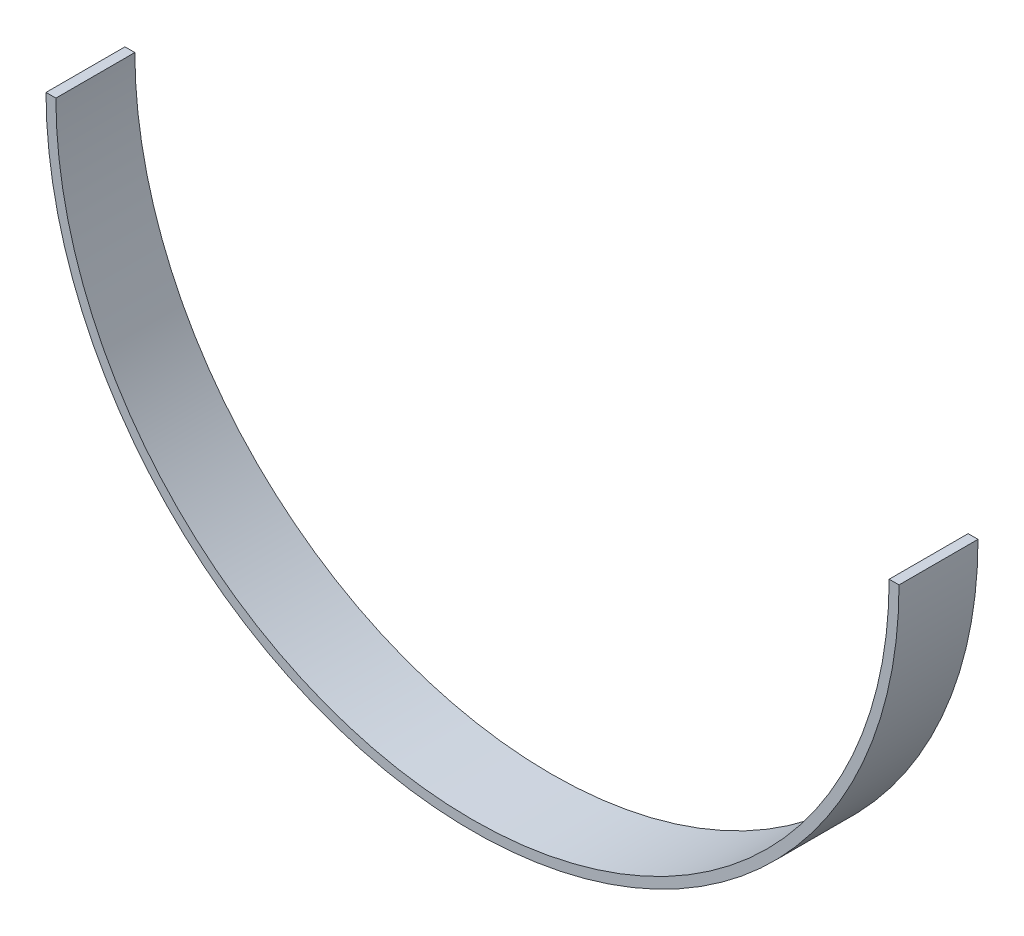
ISO-10303-21;
HEADER;
FILE_DESCRIPTION(('STEP AP214'),'2;1');
FILE_NAME('part.step','',(''),(''),'','','');
FILE_SCHEMA(('AUTOMOTIVE_DESIGN { 1 0 10303 214 1 1 1 1 }'));
ENDSEC;
DATA;
#1=APPLICATION_CONTEXT('core data for automotive mechanical design processes');
#2=APPLICATION_PROTOCOL_DEFINITION('international standard','automotive_design',2000,#1);
#3=PRODUCT_CONTEXT('',#1,'mechanical');
#4=PRODUCT('Part','Part','',(#3));
#5=PRODUCT_RELATED_PRODUCT_CATEGORY('part','',(#4));
#6=PRODUCT_DEFINITION_FORMATION('','',#4);
#7=PRODUCT_DEFINITION_CONTEXT('part definition',#1,'design');
#8=PRODUCT_DEFINITION('design','',#6,#7);
#9=PRODUCT_DEFINITION_SHAPE('','',#8);
#10=(LENGTH_UNIT() NAMED_UNIT(*) SI_UNIT(.MILLI.,.METRE.));
#11=(NAMED_UNIT(*) PLANE_ANGLE_UNIT() SI_UNIT($,.RADIAN.));
#12=(NAMED_UNIT(*) SI_UNIT($,.STERADIAN.) SOLID_ANGLE_UNIT());
#13=UNCERTAINTY_MEASURE_WITH_UNIT(LENGTH_MEASURE(1.E-05),#10,'distance_accuracy_value','');
#14=(GEOMETRIC_REPRESENTATION_CONTEXT(3) GLOBAL_UNCERTAINTY_ASSIGNED_CONTEXT((#13)) GLOBAL_UNIT_ASSIGNED_CONTEXT((#10,
#11,#12)) REPRESENTATION_CONTEXT('',''));
#15=CARTESIAN_POINT('',(0.,0.,0.));
#16=DIRECTION('',(0.,0.,1.));
#17=DIRECTION('',(1.,0.,0.));
#18=AXIS2_PLACEMENT_3D('',#15,#16,#17);
#19=CARTESIAN_POINT('',(0.,0.,63.5));
#20=DIRECTION('',(0.,0.,-1.));
#21=DIRECTION('',(-1.,0.,0.));
#22=AXIS2_PLACEMENT_3D('',#19,#20,#21);
#23=CYLINDRICAL_SURFACE('',#22,342.9635);
#24=CARTESIAN_POINT('',(0.,0.,0.));
#25=DIRECTION('',(0.,0.,1.));
#26=DIRECTION('',(1.,0.,0.));
#27=AXIS2_PLACEMENT_3D('',#24,#25,#26);
#28=CIRCLE('',#27,342.9635);
#29=CARTESIAN_POINT('',(-342.9635,0.,0.));
#30=VERTEX_POINT('',#29);
#31=CARTESIAN_POINT('',(342.9635,0.,0.));
#32=VERTEX_POINT('',#31);
#33=EDGE_CURVE('E104',#30,#32,#28,.T.);
#34=ORIENTED_EDGE('',*,*,#33,.T.);
#35=DIRECTION('',(0.,0.,-1.));
#36=VECTOR('',#35,1.);
#37=CARTESIAN_POINT('',(342.9635,0.,63.5));
#38=LINE('',#37,#36);
#39=CARTESIAN_POINT('',(342.9635,0.,63.5));
#40=VERTEX_POINT('',#39);
#41=EDGE_CURVE('E11',#40,#32,#38,.T.);
#42=ORIENTED_EDGE('',*,*,#41,.F.);
#43=CARTESIAN_POINT('',(0.,0.,63.5));
#44=DIRECTION('',(0.,0.,1.));
#45=DIRECTION('',(1.,0.,0.));
#46=AXIS2_PLACEMENT_3D('',#43,#44,#45);
#47=CIRCLE('',#46,342.9635);
#48=CARTESIAN_POINT('',(-342.9635,0.,63.5));
#49=VERTEX_POINT('',#48);
#50=EDGE_CURVE('E81',#49,#40,#47,.T.);
#51=ORIENTED_EDGE('',*,*,#50,.F.);
#52=DIRECTION('',(0.,0.,-1.));
#53=VECTOR('',#52,1.);
#54=CARTESIAN_POINT('',(-342.9635,0.,63.5));
#55=LINE('',#54,#53);
#56=EDGE_CURVE('E57',#49,#30,#55,.T.);
#57=ORIENTED_EDGE('',*,*,#56,.T.);
#58=EDGE_LOOP('',(#34,#42,#51,#57));
#59=FACE_BOUND('',#58,.T.);
#60=ADVANCED_FACE('F41',(#59),#23,.T.);
#61=CARTESIAN_POINT('',(335.026,0.,63.5));
#62=DIRECTION('',(0.,1.,0.));
#63=DIRECTION('',(0.,0.,1.));
#64=AXIS2_PLACEMENT_3D('',#61,#62,#63);
#65=PLANE('',#64);
#66=DIRECTION('',(1.,0.,0.));
#67=VECTOR('',#66,1.);
#68=CARTESIAN_POINT('',(335.026,0.,0.));
#69=LINE('',#68,#67);
#70=CARTESIAN_POINT('',(335.026,0.,0.));
#71=VERTEX_POINT('',#70);
#72=EDGE_CURVE('E90',#71,#32,#69,.T.);
#73=ORIENTED_EDGE('',*,*,#72,.F.);
#74=DIRECTION('',(0.,0.,-1.));
#75=VECTOR('',#74,1.);
#76=CARTESIAN_POINT('',(335.026,0.,63.5));
#77=LINE('',#76,#75);
#78=CARTESIAN_POINT('',(335.026,0.,63.5));
#79=VERTEX_POINT('',#78);
#80=EDGE_CURVE('E49',#79,#71,#77,.T.);
#81=ORIENTED_EDGE('',*,*,#80,.F.);
#82=DIRECTION('',(1.,0.,0.));
#83=VECTOR('',#82,1.);
#84=CARTESIAN_POINT('',(335.026,0.,63.5));
#85=LINE('',#84,#83);
#86=EDGE_CURVE('E88',#79,#40,#85,.T.);
#87=ORIENTED_EDGE('',*,*,#86,.T.);
#88=ORIENTED_EDGE('',*,*,#41,.T.);
#89=EDGE_LOOP('',(#73,#81,#87,#88));
#90=FACE_BOUND('',#89,.T.);
#91=ADVANCED_FACE('F87',(#90),#65,.T.);
#92=CARTESIAN_POINT('',(0.,0.,63.5));
#93=DIRECTION('',(0.,0.,-1.));
#94=DIRECTION('',(-1.,0.,0.));
#95=AXIS2_PLACEMENT_3D('',#92,#93,#94);
#96=CYLINDRICAL_SURFACE('',#95,335.026);
#97=CARTESIAN_POINT('',(0.,0.,0.));
#98=DIRECTION('',(0.,0.,1.));
#99=DIRECTION('',(1.,0.,0.));
#100=AXIS2_PLACEMENT_3D('',#97,#98,#99);
#101=CIRCLE('',#100,335.026);
#102=CARTESIAN_POINT('',(-335.026,0.,0.));
#103=VERTEX_POINT('',#102);
#104=EDGE_CURVE('E107',#103,#71,#101,.T.);
#105=ORIENTED_EDGE('',*,*,#104,.F.);
#106=DIRECTION('',(0.,0.,-1.));
#107=VECTOR('',#106,1.);
#108=CARTESIAN_POINT('',(-335.026,0.,63.5));
#109=LINE('',#108,#107);
#110=CARTESIAN_POINT('',(-335.026,0.,63.5));
#111=VERTEX_POINT('',#110);
#112=EDGE_CURVE('E70',#111,#103,#109,.T.);
#113=ORIENTED_EDGE('',*,*,#112,.F.);
#114=CARTESIAN_POINT('',(0.,0.,63.5));
#115=DIRECTION('',(0.,0.,1.));
#116=DIRECTION('',(1.,0.,0.));
#117=AXIS2_PLACEMENT_3D('',#114,#115,#116);
#118=CIRCLE('',#117,335.026);
#119=EDGE_CURVE('E96',#111,#79,#118,.T.);
#120=ORIENTED_EDGE('',*,*,#119,.T.);
#121=ORIENTED_EDGE('',*,*,#80,.T.);
#122=EDGE_LOOP('',(#105,#113,#120,#121));
#123=FACE_BOUND('',#122,.T.);
#124=ADVANCED_FACE('F98',(#123),#96,.F.);
#125=CARTESIAN_POINT('',(-342.9635,0.,63.5));
#126=DIRECTION('',(0.,1.,0.));
#127=DIRECTION('',(-1.,0.,0.));
#128=AXIS2_PLACEMENT_3D('',#125,#126,#127);
#129=PLANE('',#128);
#130=DIRECTION('',(1.,0.,0.));
#131=VECTOR('',#130,1.);
#132=CARTESIAN_POINT('',(-342.9635,0.,0.));
#133=LINE('',#132,#131);
#134=EDGE_CURVE('E109',#30,#103,#133,.T.);
#135=ORIENTED_EDGE('',*,*,#134,.F.);
#136=ORIENTED_EDGE('',*,*,#56,.F.);
#137=DIRECTION('',(1.,0.,0.));
#138=VECTOR('',#137,1.);
#139=CARTESIAN_POINT('',(-342.9635,0.,63.5));
#140=LINE('',#139,#138);
#141=EDGE_CURVE('E99',#49,#111,#140,.T.);
#142=ORIENTED_EDGE('',*,*,#141,.T.);
#143=ORIENTED_EDGE('',*,*,#112,.T.);
#144=EDGE_LOOP('',(#135,#136,#142,#143));
#145=FACE_BOUND('',#144,.T.);
#146=ADVANCED_FACE('F115',(#145),#129,.T.);
#147=CARTESIAN_POINT('',(0.,0.,63.5));
#148=DIRECTION('',(0.,0.,1.));
#149=DIRECTION('',(1.,0.,0.));
#150=AXIS2_PLACEMENT_3D('',#147,#148,#149);
#151=PLANE('',#150);
#152=ORIENTED_EDGE('',*,*,#50,.T.);
#153=ORIENTED_EDGE('',*,*,#86,.F.);
#154=ORIENTED_EDGE('',*,*,#119,.F.);
#155=ORIENTED_EDGE('',*,*,#141,.F.);
#156=EDGE_LOOP('',(#152,#153,#154,#155));
#157=FACE_BOUND('',#156,.T.);
#158=ADVANCED_FACE('F95',(#157),#151,.T.);
#159=CARTESIAN_POINT('',(0.,0.,0.));
#160=DIRECTION('',(0.,0.,1.));
#161=DIRECTION('',(1.,0.,0.));
#162=AXIS2_PLACEMENT_3D('',#159,#160,#161);
#163=PLANE('',#162);
#164=ORIENTED_EDGE('',*,*,#33,.F.);
#165=ORIENTED_EDGE('',*,*,#134,.T.);
#166=ORIENTED_EDGE('',*,*,#104,.T.);
#167=ORIENTED_EDGE('',*,*,#72,.T.);
#168=EDGE_LOOP('',(#164,#165,#166,#167));
#169=FACE_BOUND('',#168,.T.);
#170=ADVANCED_FACE('F114',(#169),#163,.F.);
#171=CLOSED_SHELL('',(#60,#91,#124,#146,#158,#170));
#172=MANIFOLD_SOLID_BREP('B2',#171);
#173=ADVANCED_BREP_SHAPE_REPRESENTATION('',(#18,#172),#14);
#174=SHAPE_DEFINITION_REPRESENTATION(#9,#173);
ENDSEC;
END-ISO-10303-21;
